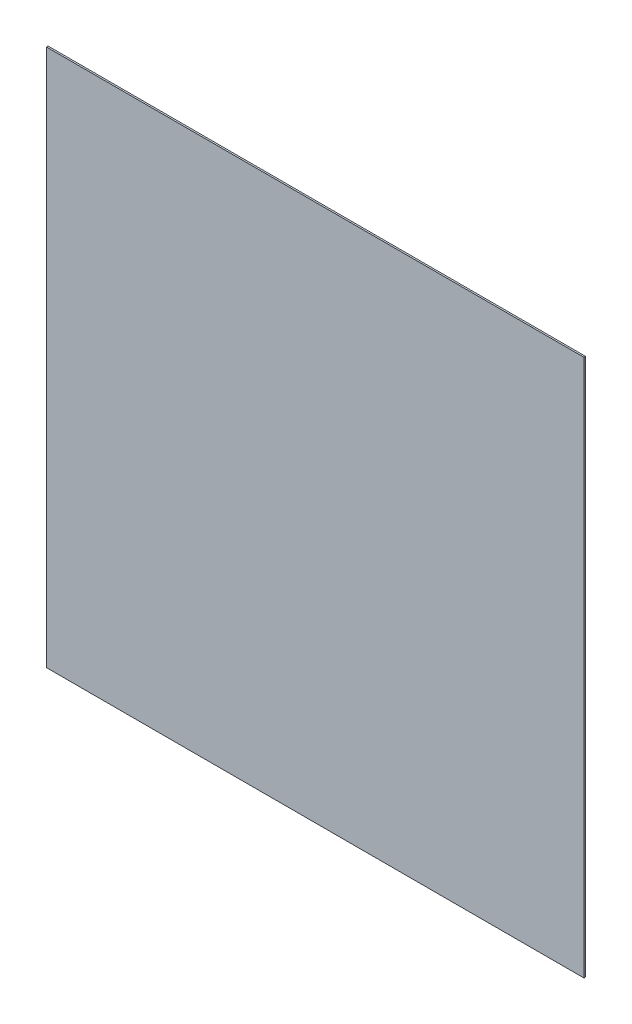
ISO-10303-21;
HEADER;
FILE_DESCRIPTION(('STEP AP214'),'2;1');
FILE_NAME('part.step','',(''),(''),'','','');
FILE_SCHEMA(('AUTOMOTIVE_DESIGN { 1 0 10303 214 1 1 1 1 }'));
ENDSEC;
DATA;
#1=APPLICATION_CONTEXT('core data for automotive mechanical design processes');
#2=APPLICATION_PROTOCOL_DEFINITION('international standard','automotive_design',2000,#1);
#3=PRODUCT_CONTEXT('',#1,'mechanical');
#4=PRODUCT('Part','Part','',(#3));
#5=PRODUCT_RELATED_PRODUCT_CATEGORY('part','',(#4));
#6=PRODUCT_DEFINITION_FORMATION('','',#4);
#7=PRODUCT_DEFINITION_CONTEXT('part definition',#1,'design');
#8=PRODUCT_DEFINITION('design','',#6,#7);
#9=PRODUCT_DEFINITION_SHAPE('','',#8);
#10=(LENGTH_UNIT() NAMED_UNIT(*) SI_UNIT(.MILLI.,.METRE.));
#11=(NAMED_UNIT(*) PLANE_ANGLE_UNIT() SI_UNIT($,.RADIAN.));
#12=(NAMED_UNIT(*) SI_UNIT($,.STERADIAN.) SOLID_ANGLE_UNIT());
#13=UNCERTAINTY_MEASURE_WITH_UNIT(LENGTH_MEASURE(1.E-05),#10,'distance_accuracy_value','');
#14=(GEOMETRIC_REPRESENTATION_CONTEXT(3) GLOBAL_UNCERTAINTY_ASSIGNED_CONTEXT((#13)) GLOBAL_UNIT_ASSIGNED_CONTEXT((#10,
#11,#12)) REPRESENTATION_CONTEXT('',''));
#15=CARTESIAN_POINT('',(0.,0.,0.));
#16=DIRECTION('',(0.,0.,1.));
#17=DIRECTION('',(1.,0.,0.));
#18=AXIS2_PLACEMENT_3D('',#15,#16,#17);
#19=CARTESIAN_POINT('',(62.7700680934936,35.4667550842403,13.74394));
#20=DIRECTION('',(0.,1.,0.));
#21=DIRECTION('',(0.,0.,-1.));
#22=AXIS2_PLACEMENT_3D('',#19,#20,#21);
#23=PLANE('',#22);
#24=DIRECTION('',(1.,0.,0.));
#25=VECTOR('',#24,1.);
#26=CARTESIAN_POINT('',(57.8170680934936,35.4667550842403,13.716));
#27=LINE('',#26,#25);
#28=CARTESIAN_POINT('',(53.6895680934936,35.4667550842403,13.716));
#29=VERTEX_POINT('',#28);
#30=CARTESIAN_POINT('',(61.9445680934936,35.4667550842403,13.716));
#31=VERTEX_POINT('',#30);
#32=EDGE_CURVE('E77',#29,#31,#27,.T.);
#33=ORIENTED_EDGE('',*,*,#32,.F.);
#34=DIRECTION('',(0.,0.,-1.));
#35=VECTOR('',#34,1.);
#36=CARTESIAN_POINT('',(53.6895680934936,35.4667550842403,13.7287));
#37=LINE('',#36,#35);
#38=CARTESIAN_POINT('',(53.6895680934936,35.4667550842403,13.7414));
#39=VERTEX_POINT('',#38);
#40=EDGE_CURVE('E69',#39,#29,#37,.T.);
#41=ORIENTED_EDGE('',*,*,#40,.F.);
#42=DIRECTION('',(-1.,0.,0.));
#43=VECTOR('',#42,1.);
#44=CARTESIAN_POINT('',(57.8170680934936,35.4667550842403,13.7414));
#45=LINE('',#44,#43);
#46=CARTESIAN_POINT('',(61.9445680934936,35.4667550842403,13.7414));
#47=VERTEX_POINT('',#46);
#48=EDGE_CURVE('E68',#47,#39,#45,.T.);
#49=ORIENTED_EDGE('',*,*,#48,.F.);
#50=DIRECTION('',(0.,0.,-1.));
#51=VECTOR('',#50,1.);
#52=CARTESIAN_POINT('',(61.9445680934936,35.4667550842403,13.7287));
#53=LINE('',#52,#51);
#54=EDGE_CURVE('E34',#47,#31,#53,.T.);
#55=ORIENTED_EDGE('',*,*,#54,.T.);
#56=EDGE_LOOP('',(#33,#41,#49,#55));
#57=FACE_BOUND('',#56,.T.);
#58=ADVANCED_FACE('F17',(#57),#23,.T.);
#59=CARTESIAN_POINT('',(62.7700680934936,27.2117550842403,13.71346));
#60=DIRECTION('',(0.,-1.,0.));
#61=DIRECTION('',(0.,0.,1.));
#62=AXIS2_PLACEMENT_3D('',#59,#60,#61);
#63=PLANE('',#62);
#64=DIRECTION('',(-1.,0.,0.));
#65=VECTOR('',#64,1.);
#66=CARTESIAN_POINT('',(57.8170680934936,27.2117550842403,13.716));
#67=LINE('',#66,#65);
#68=CARTESIAN_POINT('',(61.9445680934936,27.2117550842403,13.716));
#69=VERTEX_POINT('',#68);
#70=CARTESIAN_POINT('',(53.6895680934936,27.2117550842403,13.716));
#71=VERTEX_POINT('',#70);
#72=EDGE_CURVE('E85',#69,#71,#67,.T.);
#73=ORIENTED_EDGE('',*,*,#72,.F.);
#74=DIRECTION('',(0.,0.,1.));
#75=VECTOR('',#74,1.);
#76=CARTESIAN_POINT('',(61.9445680934936,27.2117550842403,13.7287));
#77=LINE('',#76,#75);
#78=CARTESIAN_POINT('',(61.9445680934936,27.2117550842403,13.7414));
#79=VERTEX_POINT('',#78);
#80=EDGE_CURVE('E74',#69,#79,#77,.T.);
#81=ORIENTED_EDGE('',*,*,#80,.T.);
#82=DIRECTION('',(1.,0.,0.));
#83=VECTOR('',#82,1.);
#84=CARTESIAN_POINT('',(57.8170680934936,27.2117550842403,13.7414));
#85=LINE('',#84,#83);
#86=CARTESIAN_POINT('',(53.6895680934936,27.2117550842403,13.7414));
#87=VERTEX_POINT('',#86);
#88=EDGE_CURVE('E72',#87,#79,#85,.T.);
#89=ORIENTED_EDGE('',*,*,#88,.F.);
#90=DIRECTION('',(0.,0.,1.));
#91=VECTOR('',#90,1.);
#92=CARTESIAN_POINT('',(53.6895680934936,27.2117550842403,13.7287));
#93=LINE('',#92,#91);
#94=EDGE_CURVE('E51',#71,#87,#93,.T.);
#95=ORIENTED_EDGE('',*,*,#94,.F.);
#96=EDGE_LOOP('',(#73,#81,#89,#95));
#97=FACE_BOUND('',#96,.T.);
#98=ADVANCED_FACE('F73',(#97),#63,.T.);
#99=CARTESIAN_POINT('',(53.6895680934936,36.2922550842403,13.74394));
#100=DIRECTION('',(-1.,0.,0.));
#101=DIRECTION('',(0.,0.,-1.));
#102=AXIS2_PLACEMENT_3D('',#99,#100,#101);
#103=PLANE('',#102);
#104=DIRECTION('',(0.,1.,0.));
#105=VECTOR('',#104,1.);
#106=CARTESIAN_POINT('',(53.6895680934936,31.3392550842403,13.716));
#107=LINE('',#106,#105);
#108=EDGE_CURVE('E66',#71,#29,#107,.T.);
#109=ORIENTED_EDGE('',*,*,#108,.F.);
#110=ORIENTED_EDGE('',*,*,#94,.T.);
#111=DIRECTION('',(0.,-1.,0.));
#112=VECTOR('',#111,1.);
#113=CARTESIAN_POINT('',(53.6895680934936,31.3392550842403,13.7414));
#114=LINE('',#113,#112);
#115=EDGE_CURVE('E63',#39,#87,#114,.T.);
#116=ORIENTED_EDGE('',*,*,#115,.F.);
#117=ORIENTED_EDGE('',*,*,#40,.T.);
#118=EDGE_LOOP('',(#109,#110,#116,#117));
#119=FACE_BOUND('',#118,.T.);
#120=ADVANCED_FACE('F60',(#119),#103,.T.);
#121=CARTESIAN_POINT('',(52.8640680934936,26.3862550842403,13.7414));
#122=DIRECTION('',(0.,0.,1.));
#123=DIRECTION('',(1.,0.,0.));
#124=AXIS2_PLACEMENT_3D('',#121,#122,#123);
#125=PLANE('',#124);
#126=ORIENTED_EDGE('',*,*,#115,.T.);
#127=ORIENTED_EDGE('',*,*,#88,.T.);
#128=DIRECTION('',(0.,-1.,0.));
#129=VECTOR('',#128,1.);
#130=CARTESIAN_POINT('',(61.9445680934936,31.3392550842403,13.7414));
#131=LINE('',#130,#129);
#132=EDGE_CURVE('E21',#47,#79,#131,.T.);
#133=ORIENTED_EDGE('',*,*,#132,.F.);
#134=ORIENTED_EDGE('',*,*,#48,.T.);
#135=EDGE_LOOP('',(#126,#127,#133,#134));
#136=FACE_BOUND('',#135,.T.);
#137=ADVANCED_FACE('F79',(#136),#125,.T.);
#138=CARTESIAN_POINT('',(52.8640680934936,36.2922550842403,13.716));
#139=DIRECTION('',(0.,0.,-1.));
#140=DIRECTION('',(1.,0.,0.));
#141=AXIS2_PLACEMENT_3D('',#138,#139,#140);
#142=PLANE('',#141);
#143=ORIENTED_EDGE('',*,*,#72,.T.);
#144=ORIENTED_EDGE('',*,*,#108,.T.);
#145=ORIENTED_EDGE('',*,*,#32,.T.);
#146=DIRECTION('',(0.,1.,0.));
#147=VECTOR('',#146,1.);
#148=CARTESIAN_POINT('',(61.9445680934936,31.3392550842403,13.716));
#149=LINE('',#148,#147);
#150=EDGE_CURVE('E11',#69,#31,#149,.T.);
#151=ORIENTED_EDGE('',*,*,#150,.F.);
#152=EDGE_LOOP('',(#143,#144,#145,#151));
#153=FACE_BOUND('',#152,.T.);
#154=ADVANCED_FACE('F89',(#153),#142,.T.);
#155=CARTESIAN_POINT('',(61.9445680934936,36.2922550842403,13.71346));
#156=DIRECTION('',(1.,0.,0.));
#157=DIRECTION('',(0.,0.,1.));
#158=AXIS2_PLACEMENT_3D('',#155,#156,#157);
#159=PLANE('',#158);
#160=ORIENTED_EDGE('',*,*,#150,.T.);
#161=ORIENTED_EDGE('',*,*,#54,.F.);
#162=ORIENTED_EDGE('',*,*,#132,.T.);
#163=ORIENTED_EDGE('',*,*,#80,.F.);
#164=EDGE_LOOP('',(#160,#161,#162,#163));
#165=FACE_BOUND('',#164,.T.);
#166=ADVANCED_FACE('F19',(#165),#159,.T.);
#167=CLOSED_SHELL('',(#58,#98,#120,#137,#154,#166));
#168=MANIFOLD_SOLID_BREP('B1',#167);
#169=ADVANCED_BREP_SHAPE_REPRESENTATION('',(#18,#168),#14);
#170=SHAPE_DEFINITION_REPRESENTATION(#9,#169);
ENDSEC;
END-ISO-10303-21;
